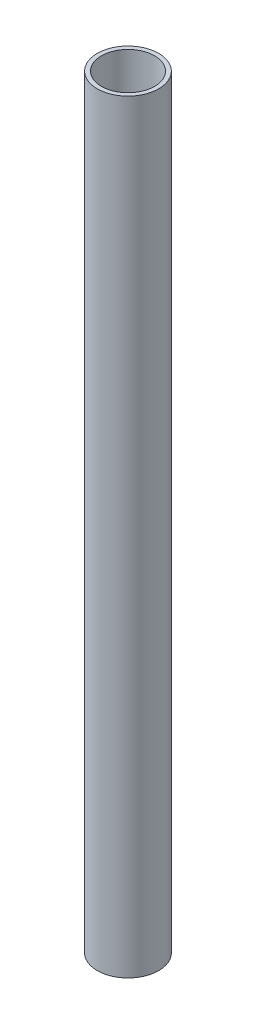
ISO-10303-21;
HEADER;
FILE_DESCRIPTION(('STEP AP214'),'2;1');
FILE_NAME('part.step','',(''),(''),'','','');
FILE_SCHEMA(('AUTOMOTIVE_DESIGN { 1 0 10303 214 1 1 1 1 }'));
ENDSEC;
DATA;
#1=APPLICATION_CONTEXT('core data for automotive mechanical design processes');
#2=APPLICATION_PROTOCOL_DEFINITION('international standard','automotive_design',2000,#1);
#3=PRODUCT_CONTEXT('',#1,'mechanical');
#4=PRODUCT('Part','Part','',(#3));
#5=PRODUCT_RELATED_PRODUCT_CATEGORY('part','',(#4));
#6=PRODUCT_DEFINITION_FORMATION('','',#4);
#7=PRODUCT_DEFINITION_CONTEXT('part definition',#1,'design');
#8=PRODUCT_DEFINITION('design','',#6,#7);
#9=PRODUCT_DEFINITION_SHAPE('','',#8);
#10=(LENGTH_UNIT() NAMED_UNIT(*) SI_UNIT(.MILLI.,.METRE.));
#11=(NAMED_UNIT(*) PLANE_ANGLE_UNIT() SI_UNIT($,.RADIAN.));
#12=(NAMED_UNIT(*) SI_UNIT($,.STERADIAN.) SOLID_ANGLE_UNIT());
#13=UNCERTAINTY_MEASURE_WITH_UNIT(LENGTH_MEASURE(1.E-05),#10,'distance_accuracy_value','');
#14=(GEOMETRIC_REPRESENTATION_CONTEXT(3) GLOBAL_UNCERTAINTY_ASSIGNED_CONTEXT((#13)) GLOBAL_UNIT_ASSIGNED_CONTEXT((#10,
#11,#12)) REPRESENTATION_CONTEXT('',''));
#15=CARTESIAN_POINT('',(0.,0.,0.));
#16=DIRECTION('',(0.,0.,1.));
#17=DIRECTION('',(1.,0.,0.));
#18=AXIS2_PLACEMENT_3D('',#15,#16,#17);
#19=CARTESIAN_POINT('',(0.,460.,0.));
#20=DIRECTION('',(0.,1.,0.));
#21=DIRECTION('',(0.,0.,1.));
#22=AXIS2_PLACEMENT_3D('',#19,#20,#21);
#23=PLANE('',#22);
#24=CARTESIAN_POINT('',(0.,460.,0.));
#25=DIRECTION('',(0.,1.,0.));
#26=DIRECTION('',(0.,0.,1.));
#27=AXIS2_PLACEMENT_3D('',#24,#25,#26);
#28=CIRCLE('',#27,18.5);
#29=CARTESIAN_POINT('',(0.,460.,18.5));
#30=VERTEX_POINT('',#29);
#31=EDGE_CURVE('E11',#30,#30,#28,.T.);
#32=ORIENTED_EDGE('',*,*,#31,.T.);
#33=EDGE_LOOP('',(#32));
#34=FACE_BOUND('',#33,.T.);
#35=CARTESIAN_POINT('',(0.,460.,0.));
#36=DIRECTION('',(0.,1.,0.));
#37=DIRECTION('',(0.,0.,1.));
#38=AXIS2_PLACEMENT_3D('',#35,#36,#37);
#39=CIRCLE('',#38,16.);
#40=CARTESIAN_POINT('',(0.,460.,16.));
#41=VERTEX_POINT('',#40);
#42=EDGE_CURVE('E51',#41,#41,#39,.T.);
#43=ORIENTED_EDGE('',*,*,#42,.F.);
#44=EDGE_LOOP('',(#43));
#45=FACE_BOUND('',#44,.T.);
#46=ADVANCED_FACE('F40',(#34,#45),#23,.T.);
#47=CARTESIAN_POINT('',(0.,0.,0.));
#48=DIRECTION('',(0.,1.,0.));
#49=DIRECTION('',(0.,0.,1.));
#50=AXIS2_PLACEMENT_3D('',#47,#48,#49);
#51=PLANE('',#50);
#52=CARTESIAN_POINT('',(0.,0.,0.));
#53=DIRECTION('',(0.,1.,0.));
#54=DIRECTION('',(0.,0.,1.));
#55=AXIS2_PLACEMENT_3D('',#52,#53,#54);
#56=CIRCLE('',#55,18.5);
#57=CARTESIAN_POINT('',(0.,0.,18.5));
#58=VERTEX_POINT('',#57);
#59=EDGE_CURVE('E44',#58,#58,#56,.T.);
#60=ORIENTED_EDGE('',*,*,#59,.F.);
#61=EDGE_LOOP('',(#60));
#62=FACE_BOUND('',#61,.T.);
#63=CARTESIAN_POINT('',(0.,0.,0.));
#64=DIRECTION('',(0.,1.,0.));
#65=DIRECTION('',(0.,0.,1.));
#66=AXIS2_PLACEMENT_3D('',#63,#64,#65);
#67=CIRCLE('',#66,16.);
#68=CARTESIAN_POINT('',(0.,0.,16.));
#69=VERTEX_POINT('',#68);
#70=EDGE_CURVE('E53',#69,#69,#67,.T.);
#71=ORIENTED_EDGE('',*,*,#70,.T.);
#72=EDGE_LOOP('',(#71));
#73=FACE_BOUND('',#72,.T.);
#74=ADVANCED_FACE('F63',(#62,#73),#51,.F.);
#75=CARTESIAN_POINT('',(0.,460.,0.));
#76=DIRECTION('',(0.,-1.,0.));
#77=DIRECTION('',(0.,0.,-1.));
#78=AXIS2_PLACEMENT_3D('',#75,#76,#77);
#79=CYLINDRICAL_SURFACE('',#78,18.5);
#80=ORIENTED_EDGE('',*,*,#31,.F.);
#81=EDGE_LOOP('',(#80));
#82=FACE_BOUND('',#81,.T.);
#83=ORIENTED_EDGE('',*,*,#59,.T.);
#84=EDGE_LOOP('',(#83));
#85=FACE_BOUND('',#84,.T.);
#86=ADVANCED_FACE('F42',(#82,#85),#79,.T.);
#87=CARTESIAN_POINT('',(0.,460.,0.));
#88=DIRECTION('',(0.,-1.,0.));
#89=DIRECTION('',(0.,0.,-1.));
#90=AXIS2_PLACEMENT_3D('',#87,#88,#89);
#91=CYLINDRICAL_SURFACE('',#90,16.);
#92=ORIENTED_EDGE('',*,*,#42,.T.);
#93=EDGE_LOOP('',(#92));
#94=FACE_BOUND('',#93,.T.);
#95=ORIENTED_EDGE('',*,*,#70,.F.);
#96=EDGE_LOOP('',(#95));
#97=FACE_BOUND('',#96,.T.);
#98=ADVANCED_FACE('F59',(#94,#97),#91,.F.);
#99=CLOSED_SHELL('',(#46,#74,#86,#98));
#100=MANIFOLD_SOLID_BREP('B2',#99);
#101=ADVANCED_BREP_SHAPE_REPRESENTATION('',(#18,#100),#14);
#102=SHAPE_DEFINITION_REPRESENTATION(#9,#101);
ENDSEC;
END-ISO-10303-21;
